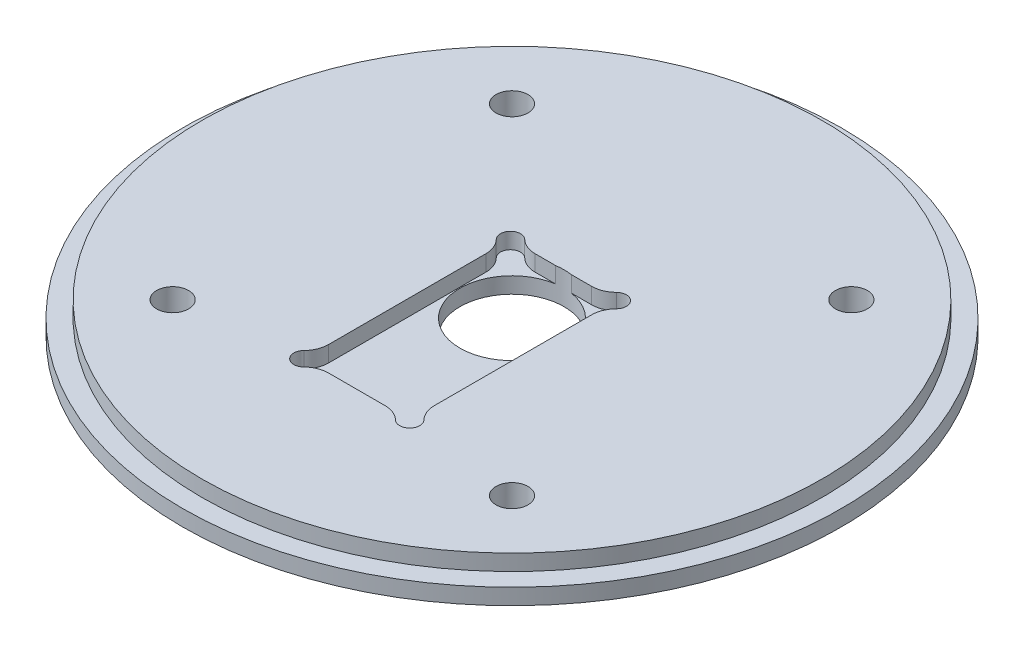
ISO-10303-21;
HEADER;
FILE_DESCRIPTION(('STEP AP214'),'2;1');
FILE_NAME('part.step','',(''),(''),'','','');
FILE_SCHEMA(('AUTOMOTIVE_DESIGN { 1 0 10303 214 1 1 1 1 }'));
ENDSEC;
DATA;
#1=APPLICATION_CONTEXT('core data for automotive mechanical design processes');
#2=APPLICATION_PROTOCOL_DEFINITION('international standard','automotive_design',2000,#1);
#3=PRODUCT_CONTEXT('',#1,'mechanical');
#4=PRODUCT('Part','Part','',(#3));
#5=PRODUCT_RELATED_PRODUCT_CATEGORY('part','',(#4));
#6=PRODUCT_DEFINITION_FORMATION('','',#4);
#7=PRODUCT_DEFINITION_CONTEXT('part definition',#1,'design');
#8=PRODUCT_DEFINITION('design','',#6,#7);
#9=PRODUCT_DEFINITION_SHAPE('','',#8);
#10=(LENGTH_UNIT() NAMED_UNIT(*) SI_UNIT(.MILLI.,.METRE.));
#11=(NAMED_UNIT(*) PLANE_ANGLE_UNIT() SI_UNIT($,.RADIAN.));
#12=(NAMED_UNIT(*) SI_UNIT($,.STERADIAN.) SOLID_ANGLE_UNIT());
#13=UNCERTAINTY_MEASURE_WITH_UNIT(LENGTH_MEASURE(1.E-05),#10,'distance_accuracy_value','');
#14=(GEOMETRIC_REPRESENTATION_CONTEXT(3) GLOBAL_UNCERTAINTY_ASSIGNED_CONTEXT((#13)) GLOBAL_UNIT_ASSIGNED_CONTEXT((#10,
#11,#12)) REPRESENTATION_CONTEXT('',''));
#15=CARTESIAN_POINT('',(0.,0.,0.));
#16=DIRECTION('',(0.,0.,1.));
#17=DIRECTION('',(1.,0.,0.));
#18=AXIS2_PLACEMENT_3D('',#15,#16,#17);
#19=CARTESIAN_POINT('',(-33.6759604540092,6.35,-33.6759604540095));
#20=DIRECTION('',(0.,1.,0.));
#21=DIRECTION('',(0.,0.,1.));
#22=AXIS2_PLACEMENT_3D('',#19,#20,#21);
#23=CYLINDRICAL_SURFACE('',#22,3.175);
#24=CARTESIAN_POINT('',(-33.6759604540092,6.35,-33.6759604540095));
#25=DIRECTION('',(0.,1.,0.));
#26=DIRECTION('',(0.,0.,1.));
#27=AXIS2_PLACEMENT_3D('',#24,#25,#26);
#28=CIRCLE('',#27,3.175);
#29=CARTESIAN_POINT('',(-33.6759604540092,6.35,-30.5009604540095));
#30=VERTEX_POINT('',#29);
#31=EDGE_CURVE('E320',#30,#30,#28,.T.);
#32=ORIENTED_EDGE('',*,*,#31,.T.);
#33=EDGE_LOOP('',(#32));
#34=FACE_BOUND('',#33,.T.);
#35=CARTESIAN_POINT('',(-33.6759604540092,1.5875,-33.6759604540095));
#36=DIRECTION('',(0.,-1.,0.));
#37=DIRECTION('',(0.,0.,-1.));
#38=AXIS2_PLACEMENT_3D('',#35,#36,#37);
#39=CIRCLE('',#38,3.175);
#40=CARTESIAN_POINT('',(-33.6759604540092,1.5875,-36.8509604540095));
#41=VERTEX_POINT('',#40);
#42=EDGE_CURVE('E43',#41,#41,#39,.F.);
#43=ORIENTED_EDGE('',*,*,#42,.F.);
#44=EDGE_LOOP('',(#43));
#45=FACE_BOUND('',#44,.T.);
#46=ADVANCED_FACE('F39',(#34,#45),#23,.F.);
#47=CARTESIAN_POINT('',(33.6759604540092,6.35,33.6759604540095));
#48=DIRECTION('',(0.,1.,0.));
#49=DIRECTION('',(0.,0.,1.));
#50=AXIS2_PLACEMENT_3D('',#47,#48,#49);
#51=CYLINDRICAL_SURFACE('',#50,3.175);
#52=CARTESIAN_POINT('',(33.6759604540092,6.35,33.6759604540095));
#53=DIRECTION('',(0.,1.,0.));
#54=DIRECTION('',(0.,0.,1.));
#55=AXIS2_PLACEMENT_3D('',#52,#53,#54);
#56=CIRCLE('',#55,3.175);
#57=CARTESIAN_POINT('',(33.6759604540092,6.35,36.8509604540095));
#58=VERTEX_POINT('',#57);
#59=EDGE_CURVE('E317',#58,#58,#56,.T.);
#60=ORIENTED_EDGE('',*,*,#59,.T.);
#61=EDGE_LOOP('',(#60));
#62=FACE_BOUND('',#61,.T.);
#63=CARTESIAN_POINT('',(33.6759604540092,1.5875,33.6759604540095));
#64=DIRECTION('',(0.,-1.,0.));
#65=DIRECTION('',(0.,0.,-1.));
#66=AXIS2_PLACEMENT_3D('',#63,#64,#65);
#67=CIRCLE('',#66,3.175);
#68=CARTESIAN_POINT('',(33.6759604540092,1.5875,30.5009604540095));
#69=VERTEX_POINT('',#68);
#70=EDGE_CURVE('E344',#69,#69,#67,.F.);
#71=ORIENTED_EDGE('',*,*,#70,.F.);
#72=EDGE_LOOP('',(#71));
#73=FACE_BOUND('',#72,.T.);
#74=ADVANCED_FACE('F354',(#62,#73),#51,.F.);
#75=CARTESIAN_POINT('',(33.6759604540095,6.35,-33.6759604540092));
#76=DIRECTION('',(0.,1.,0.));
#77=DIRECTION('',(0.,0.,1.));
#78=AXIS2_PLACEMENT_3D('',#75,#76,#77);
#79=CYLINDRICAL_SURFACE('',#78,3.175);
#80=CARTESIAN_POINT('',(33.6759604540095,6.35,-33.6759604540092));
#81=DIRECTION('',(0.,1.,0.));
#82=DIRECTION('',(0.,0.,1.));
#83=AXIS2_PLACEMENT_3D('',#80,#81,#82);
#84=CIRCLE('',#83,3.175);
#85=CARTESIAN_POINT('',(33.6759604540095,6.35,-30.5009604540092));
#86=VERTEX_POINT('',#85);
#87=EDGE_CURVE('E314',#86,#86,#84,.T.);
#88=ORIENTED_EDGE('',*,*,#87,.T.);
#89=EDGE_LOOP('',(#88));
#90=FACE_BOUND('',#89,.T.);
#91=CARTESIAN_POINT('',(33.6759604540095,1.5875,-33.6759604540092));
#92=DIRECTION('',(0.,-1.,0.));
#93=DIRECTION('',(0.,0.,-1.));
#94=AXIS2_PLACEMENT_3D('',#91,#92,#93);
#95=CIRCLE('',#94,3.175);
#96=CARTESIAN_POINT('',(33.6759604540095,1.5875,-36.8509604540092));
#97=VERTEX_POINT('',#96);
#98=EDGE_CURVE('E341',#97,#97,#95,.F.);
#99=ORIENTED_EDGE('',*,*,#98,.F.);
#100=EDGE_LOOP('',(#99));
#101=FACE_BOUND('',#100,.T.);
#102=ADVANCED_FACE('F361',(#90,#101),#79,.F.);
#103=CARTESIAN_POINT('',(-33.6759604540095,6.35,33.6759604540092));
#104=DIRECTION('',(0.,1.,0.));
#105=DIRECTION('',(0.,0.,1.));
#106=AXIS2_PLACEMENT_3D('',#103,#104,#105);
#107=CYLINDRICAL_SURFACE('',#106,3.175);
#108=CARTESIAN_POINT('',(-33.6759604540095,6.35,33.6759604540092));
#109=DIRECTION('',(0.,1.,0.));
#110=DIRECTION('',(0.,0.,1.));
#111=AXIS2_PLACEMENT_3D('',#108,#109,#110);
#112=CIRCLE('',#111,3.175);
#113=CARTESIAN_POINT('',(-33.6759604540095,6.35,36.8509604540092));
#114=VERTEX_POINT('',#113);
#115=EDGE_CURVE('E311',#114,#114,#112,.T.);
#116=ORIENTED_EDGE('',*,*,#115,.T.);
#117=EDGE_LOOP('',(#116));
#118=FACE_BOUND('',#117,.T.);
#119=CARTESIAN_POINT('',(-33.6759604540095,1.5875,33.6759604540092));
#120=DIRECTION('',(0.,-1.,0.));
#121=DIRECTION('',(0.,0.,-1.));
#122=AXIS2_PLACEMENT_3D('',#119,#120,#121);
#123=CIRCLE('',#122,3.175);
#124=CARTESIAN_POINT('',(-33.6759604540095,1.5875,30.5009604540092));
#125=VERTEX_POINT('',#124);
#126=EDGE_CURVE('E338',#125,#125,#123,.F.);
#127=ORIENTED_EDGE('',*,*,#126,.F.);
#128=EDGE_LOOP('',(#127));
#129=FACE_BOUND('',#128,.T.);
#130=ADVANCED_FACE('F386',(#118,#129),#107,.F.);
#131=CARTESIAN_POINT('',(0.,6.35,0.));
#132=DIRECTION('',(0.,-1.,0.));
#133=DIRECTION('',(0.,0.,-1.));
#134=AXIS2_PLACEMENT_3D('',#131,#132,#133);
#135=CYLINDRICAL_SURFACE('',#134,65.405);
#136=CARTESIAN_POINT('',(0.,0.,0.));
#137=DIRECTION('',(0.,1.,0.));
#138=DIRECTION('',(0.,0.,1.));
#139=AXIS2_PLACEMENT_3D('',#136,#137,#138);
#140=CIRCLE('',#139,65.405);
#141=CARTESIAN_POINT('',(0.,0.,65.405));
#142=VERTEX_POINT('',#141);
#143=EDGE_CURVE('E332',#142,#142,#140,.T.);
#144=ORIENTED_EDGE('',*,*,#143,.T.);
#145=EDGE_LOOP('',(#144));
#146=FACE_BOUND('',#145,.T.);
#147=CARTESIAN_POINT('',(0.,3.175,0.));
#148=DIRECTION('',(0.,1.,0.));
#149=DIRECTION('',(0.,0.,1.));
#150=AXIS2_PLACEMENT_3D('',#147,#148,#149);
#151=CIRCLE('',#150,65.405);
#152=CARTESIAN_POINT('',(0.,3.175,65.405));
#153=VERTEX_POINT('',#152);
#154=EDGE_CURVE('E327',#153,#153,#151,.T.);
#155=ORIENTED_EDGE('',*,*,#154,.F.);
#156=EDGE_LOOP('',(#155));
#157=FACE_BOUND('',#156,.T.);
#158=ADVANCED_FACE('F41',(#146,#157),#135,.T.);
#159=CARTESIAN_POINT('',(0.,0.,0.));
#160=DIRECTION('',(0.,1.,0.));
#161=DIRECTION('',(0.,0.,1.));
#162=AXIS2_PLACEMENT_3D('',#159,#160,#161);
#163=PLANE('',#162);
#164=CARTESIAN_POINT('',(-33.6759604540092,0.,-33.6759604540095));
#165=DIRECTION('',(0.,-1.,0.));
#166=DIRECTION('',(0.,0.,-1.));
#167=AXIS2_PLACEMENT_3D('',#164,#165,#166);
#168=CIRCLE('',#167,6.0325);
#169=CARTESIAN_POINT('',(-33.6759604540092,0.,-39.7084604540095));
#170=VERTEX_POINT('',#169);
#171=EDGE_CURVE('E391',#170,#170,#168,.T.);
#172=ORIENTED_EDGE('',*,*,#171,.F.);
#173=EDGE_LOOP('',(#172));
#174=FACE_BOUND('',#173,.T.);
#175=CARTESIAN_POINT('',(33.6759604540095,0.,-33.6759604540092));
#176=DIRECTION('',(0.,-1.,0.));
#177=DIRECTION('',(0.,0.,-1.));
#178=AXIS2_PLACEMENT_3D('',#175,#176,#177);
#179=CIRCLE('',#178,6.0325);
#180=CARTESIAN_POINT('',(33.6759604540095,0.,-39.7084604540092));
#181=VERTEX_POINT('',#180);
#182=EDGE_CURVE('E395',#181,#181,#179,.T.);
#183=ORIENTED_EDGE('',*,*,#182,.F.);
#184=EDGE_LOOP('',(#183));
#185=FACE_BOUND('',#184,.T.);
#186=CARTESIAN_POINT('',(33.6759604540092,0.,33.6759604540095));
#187=DIRECTION('',(0.,-1.,0.));
#188=DIRECTION('',(0.,0.,-1.));
#189=AXIS2_PLACEMENT_3D('',#186,#187,#188);
#190=CIRCLE('',#189,6.0325);
#191=CARTESIAN_POINT('',(33.6759604540092,0.,27.6434604540095));
#192=VERTEX_POINT('',#191);
#193=EDGE_CURVE('E399',#192,#192,#190,.T.);
#194=ORIENTED_EDGE('',*,*,#193,.F.);
#195=EDGE_LOOP('',(#194));
#196=FACE_BOUND('',#195,.T.);
#197=CARTESIAN_POINT('',(-33.6759604540095,0.,33.6759604540092));
#198=DIRECTION('',(0.,-1.,0.));
#199=DIRECTION('',(0.,0.,-1.));
#200=AXIS2_PLACEMENT_3D('',#197,#198,#199);
#201=CIRCLE('',#200,6.0325);
#202=CARTESIAN_POINT('',(-33.6759604540095,0.,27.6434604540092));
#203=VERTEX_POINT('',#202);
#204=EDGE_CURVE('E196',#203,#203,#201,.T.);
#205=ORIENTED_EDGE('',*,*,#204,.F.);
#206=EDGE_LOOP('',(#205));
#207=FACE_BOUND('',#206,.T.);
#208=CARTESIAN_POINT('',(0.,0.,0.));
#209=DIRECTION('',(0.,1.,0.));
#210=DIRECTION('',(0.,0.,1.));
#211=AXIS2_PLACEMENT_3D('',#208,#209,#210);
#212=CIRCLE('',#211,10.31875);
#213=CARTESIAN_POINT('',(0.,0.,10.31875));
#214=VERTEX_POINT('',#213);
#215=EDGE_CURVE('E308',#214,#214,#212,.T.);
#216=ORIENTED_EDGE('',*,*,#215,.T.);
#217=EDGE_LOOP('',(#216));
#218=FACE_BOUND('',#217,.T.);
#219=ORIENTED_EDGE('',*,*,#143,.F.);
#220=EDGE_LOOP('',(#219));
#221=FACE_BOUND('',#220,.T.);
#222=ADVANCED_FACE('F374',(#174,#185,#196,#207,#218,#221),#163,.F.);
#223=CARTESIAN_POINT('',(0.,3.175,0.));
#224=DIRECTION('',(0.,1.,0.));
#225=DIRECTION('',(0.,0.,1.));
#226=AXIS2_PLACEMENT_3D('',#223,#224,#225);
#227=PLANE('',#226);
#228=CARTESIAN_POINT('',(0.,3.175,0.));
#229=DIRECTION('',(0.,1.,0.));
#230=DIRECTION('',(0.,0.,1.));
#231=AXIS2_PLACEMENT_3D('',#228,#229,#230);
#232=CIRCLE('',#231,61.595);
#233=CARTESIAN_POINT('',(0.,3.175,61.595));
#234=VERTEX_POINT('',#233);
#235=EDGE_CURVE('E324',#234,#234,#232,.T.);
#236=ORIENTED_EDGE('',*,*,#235,.F.);
#237=EDGE_LOOP('',(#236));
#238=FACE_BOUND('',#237,.T.);
#239=ORIENTED_EDGE('',*,*,#154,.T.);
#240=EDGE_LOOP('',(#239));
#241=FACE_BOUND('',#240,.T.);
#242=ADVANCED_FACE('F370',(#238,#241),#227,.T.);
#243=CARTESIAN_POINT('',(0.,3.175,0.));
#244=DIRECTION('',(0.,1.,0.));
#245=DIRECTION('',(0.,0.,1.));
#246=AXIS2_PLACEMENT_3D('',#243,#244,#245);
#247=CYLINDRICAL_SURFACE('',#246,61.595);
#248=ORIENTED_EDGE('',*,*,#235,.T.);
#249=EDGE_LOOP('',(#248));
#250=FACE_BOUND('',#249,.T.);
#251=CARTESIAN_POINT('',(0.,6.35,0.));
#252=DIRECTION('',(0.,1.,0.));
#253=DIRECTION('',(0.,0.,1.));
#254=AXIS2_PLACEMENT_3D('',#251,#252,#253);
#255=CIRCLE('',#254,61.595);
#256=CARTESIAN_POINT('',(0.,6.35,61.595));
#257=VERTEX_POINT('',#256);
#258=EDGE_CURVE('E323',#257,#257,#255,.T.);
#259=ORIENTED_EDGE('',*,*,#258,.F.);
#260=EDGE_LOOP('',(#259));
#261=FACE_BOUND('',#260,.T.);
#262=ADVANCED_FACE('F366',(#250,#261),#247,.T.);
#263=CARTESIAN_POINT('',(0.,6.35,0.));
#264=DIRECTION('',(0.,1.,0.));
#265=DIRECTION('',(0.,0.,1.));
#266=AXIS2_PLACEMENT_3D('',#263,#264,#265);
#267=PLANE('',#266);
#268=DIRECTION('',(-1.,0.,0.));
#269=VECTOR('',#268,1.);
#270=CARTESIAN_POINT('',(-5.60102051443364,6.35,-10.2));
#271=LINE('',#270,#269);
#272=CARTESIAN_POINT('',(-1.56096174280472,6.35,-10.2));
#273=VERTEX_POINT('',#272);
#274=CARTESIAN_POINT('',(-5.60102051443364,6.35,-10.2));
#275=VERTEX_POINT('',#274);
#276=EDGE_CURVE('E264',#273,#275,#271,.T.);
#277=ORIENTED_EDGE('',*,*,#276,.F.);
#278=CARTESIAN_POINT('',(0.,6.35,0.));
#279=DIRECTION('',(0.,1.,0.));
#280=DIRECTION('',(0.,0.,1.));
#281=AXIS2_PLACEMENT_3D('',#278,#279,#280);
#282=CIRCLE('',#281,10.31875);
#283=CARTESIAN_POINT('',(1.56096174280472,6.35,-10.2));
#284=VERTEX_POINT('',#283);
#285=EDGE_CURVE('E277',#284,#273,#282,.T.);
#286=ORIENTED_EDGE('',*,*,#285,.F.);
#287=CARTESIAN_POINT('',(5.60102051443364,6.35,-10.2));
#288=VERTEX_POINT('',#287);
#289=EDGE_CURVE('E265',#288,#284,#271,.T.);
#290=ORIENTED_EDGE('',*,*,#289,.F.);
#291=CARTESIAN_POINT('',(5.60102051443364,6.35,-15.2));
#292=DIRECTION('',(0.,-1.,0.));
#293=DIRECTION('',(0.,0.,-1.));
#294=AXIS2_PLACEMENT_3D('',#291,#292,#293);
#295=CIRCLE('',#294,5.);
#296=CARTESIAN_POINT('',(9.10029157555247,6.35,-11.6285714285714));
#297=VERTEX_POINT('',#296);
#298=EDGE_CURVE('E261',#297,#288,#295,.T.);
#299=ORIENTED_EDGE('',*,*,#298,.F.);
#300=CARTESIAN_POINT('',(10.5,6.35,-10.2));
#301=DIRECTION('',(0.,1.,0.));
#302=DIRECTION('',(0.,0.,1.));
#303=AXIS2_PLACEMENT_3D('',#300,#301,#302);
#304=CIRCLE('',#303,2.);
#305=CARTESIAN_POINT('',(11.9285714285714,6.35,-8.80029157555247));
#306=VERTEX_POINT('',#305);
#307=EDGE_CURVE('E258',#306,#297,#304,.T.);
#308=ORIENTED_EDGE('',*,*,#307,.F.);
#309=CARTESIAN_POINT('',(15.5,6.35,-5.30102051443365));
#310=DIRECTION('',(0.,-1.,0.));
#311=DIRECTION('',(0.,0.,1.));
#312=AXIS2_PLACEMENT_3D('',#309,#310,#311);
#313=CIRCLE('',#312,5.);
#314=CARTESIAN_POINT('',(10.5,6.35,-5.30102051443365));
#315=VERTEX_POINT('',#314);
#316=EDGE_CURVE('E255',#315,#306,#313,.T.);
#317=ORIENTED_EDGE('',*,*,#316,.F.);
#318=DIRECTION('',(0.,0.,-1.));
#319=VECTOR('',#318,1.);
#320=CARTESIAN_POINT('',(10.5,6.35,-5.30102051443365));
#321=LINE('',#320,#319);
#322=CARTESIAN_POINT('',(10.5,6.35,25.9010205144336));
#323=VERTEX_POINT('',#322);
#324=EDGE_CURVE('E252',#323,#315,#321,.T.);
#325=ORIENTED_EDGE('',*,*,#324,.F.);
#326=CARTESIAN_POINT('',(15.5,6.35,25.9010205144336));
#327=DIRECTION('',(0.,-1.,0.));
#328=DIRECTION('',(0.,0.,-1.));
#329=AXIS2_PLACEMENT_3D('',#326,#327,#328);
#330=CIRCLE('',#329,5.);
#331=CARTESIAN_POINT('',(11.9285714285714,6.35,29.4002915755525));
#332=VERTEX_POINT('',#331);
#333=EDGE_CURVE('E249',#332,#323,#330,.T.);
#334=ORIENTED_EDGE('',*,*,#333,.F.);
#335=CARTESIAN_POINT('',(10.5,6.35,30.8));
#336=DIRECTION('',(0.,1.,0.));
#337=DIRECTION('',(0.,0.,-1.));
#338=AXIS2_PLACEMENT_3D('',#335,#336,#337);
#339=CIRCLE('',#338,2.);
#340=CARTESIAN_POINT('',(9.10029157555247,6.35,32.2285714285714));
#341=VERTEX_POINT('',#340);
#342=EDGE_CURVE('E246',#341,#332,#339,.T.);
#343=ORIENTED_EDGE('',*,*,#342,.F.);
#344=CARTESIAN_POINT('',(5.60102051443364,6.35,35.8));
#345=DIRECTION('',(0.,-1.,0.));
#346=DIRECTION('',(0.,0.,1.));
#347=AXIS2_PLACEMENT_3D('',#344,#345,#346);
#348=CIRCLE('',#347,5.);
#349=CARTESIAN_POINT('',(5.60102051443364,6.35,30.8));
#350=VERTEX_POINT('',#349);
#351=EDGE_CURVE('E243',#350,#341,#348,.T.);
#352=ORIENTED_EDGE('',*,*,#351,.F.);
#353=DIRECTION('',(1.,0.,0.));
#354=VECTOR('',#353,1.);
#355=CARTESIAN_POINT('',(-5.60102051443364,6.35,30.8));
#356=LINE('',#355,#354);
#357=CARTESIAN_POINT('',(-5.60102051443364,6.35,30.8));
#358=VERTEX_POINT('',#357);
#359=EDGE_CURVE('E240',#358,#350,#356,.T.);
#360=ORIENTED_EDGE('',*,*,#359,.F.);
#361=CARTESIAN_POINT('',(-5.60102051443364,6.35,35.8));
#362=DIRECTION('',(0.,-1.,0.));
#363=DIRECTION('',(0.,0.,-1.));
#364=AXIS2_PLACEMENT_3D('',#361,#362,#363);
#365=CIRCLE('',#364,5.);
#366=CARTESIAN_POINT('',(-9.10029157555246,6.35,32.2285714285714));
#367=VERTEX_POINT('',#366);
#368=EDGE_CURVE('E237',#367,#358,#365,.T.);
#369=ORIENTED_EDGE('',*,*,#368,.F.);
#370=CARTESIAN_POINT('',(-10.5,6.35,30.8));
#371=DIRECTION('',(0.,1.,0.));
#372=DIRECTION('',(0.,0.,1.));
#373=AXIS2_PLACEMENT_3D('',#370,#371,#372);
#374=CIRCLE('',#373,2.);
#375=CARTESIAN_POINT('',(-11.9285714285714,6.35,29.4002915755525));
#376=VERTEX_POINT('',#375);
#377=EDGE_CURVE('E235',#376,#367,#374,.T.);
#378=ORIENTED_EDGE('',*,*,#377,.F.);
#379=CARTESIAN_POINT('',(-15.5,6.35,25.9010205144336));
#380=DIRECTION('',(0.,-1.,0.));
#381=DIRECTION('',(0.,0.,1.));
#382=AXIS2_PLACEMENT_3D('',#379,#380,#381);
#383=CIRCLE('',#382,5.);
#384=CARTESIAN_POINT('',(-10.5,6.35,25.9010205144336));
#385=VERTEX_POINT('',#384);
#386=EDGE_CURVE('E173',#385,#376,#383,.T.);
#387=ORIENTED_EDGE('',*,*,#386,.F.);
#388=DIRECTION('',(0.,0.,1.));
#389=VECTOR('',#388,1.);
#390=CARTESIAN_POINT('',(-10.5,6.35,-5.30102051443365));
#391=LINE('',#390,#389);
#392=CARTESIAN_POINT('',(-10.5,6.35,-5.30102051443365));
#393=VERTEX_POINT('',#392);
#394=EDGE_CURVE('E190',#393,#385,#391,.T.);
#395=ORIENTED_EDGE('',*,*,#394,.F.);
#396=CARTESIAN_POINT('',(-15.5,6.35,-5.30102051443365));
#397=DIRECTION('',(0.,-1.,0.));
#398=DIRECTION('',(0.,0.,-1.));
#399=AXIS2_PLACEMENT_3D('',#396,#397,#398);
#400=CIRCLE('',#399,5.);
#401=CARTESIAN_POINT('',(-11.9285714285714,6.35,-8.80029157555247));
#402=VERTEX_POINT('',#401);
#403=EDGE_CURVE('E193',#402,#393,#400,.T.);
#404=ORIENTED_EDGE('',*,*,#403,.F.);
#405=CARTESIAN_POINT('',(-10.5,6.35,-10.2));
#406=DIRECTION('',(0.,1.,0.));
#407=DIRECTION('',(0.,0.,-1.));
#408=AXIS2_PLACEMENT_3D('',#405,#406,#407);
#409=CIRCLE('',#408,2.);
#410=CARTESIAN_POINT('',(-9.10029157555247,6.35,-11.6285714285714));
#411=VERTEX_POINT('',#410);
#412=EDGE_CURVE('E270',#411,#402,#409,.T.);
#413=ORIENTED_EDGE('',*,*,#412,.F.);
#414=CARTESIAN_POINT('',(-5.60102051443364,6.35,-15.2));
#415=DIRECTION('',(0.,-1.,0.));
#416=DIRECTION('',(0.,0.,1.));
#417=AXIS2_PLACEMENT_3D('',#414,#415,#416);
#418=CIRCLE('',#417,5.);
#419=EDGE_CURVE('E267',#275,#411,#418,.T.);
#420=ORIENTED_EDGE('',*,*,#419,.F.);
#421=EDGE_LOOP('',(#277,#286,#290,#299,#308,#317,#325,#334,#343,#352,#360,#369,#378,#387,#395,
#404,#413,#420));
#422=FACE_BOUND('',#421,.T.);
#423=ORIENTED_EDGE('',*,*,#115,.F.);
#424=EDGE_LOOP('',(#423));
#425=FACE_BOUND('',#424,.T.);
#426=ORIENTED_EDGE('',*,*,#87,.F.);
#427=EDGE_LOOP('',(#426));
#428=FACE_BOUND('',#427,.T.);
#429=ORIENTED_EDGE('',*,*,#59,.F.);
#430=EDGE_LOOP('',(#429));
#431=FACE_BOUND('',#430,.T.);
#432=ORIENTED_EDGE('',*,*,#31,.F.);
#433=EDGE_LOOP('',(#432));
#434=FACE_BOUND('',#433,.T.);
#435=ORIENTED_EDGE('',*,*,#258,.T.);
#436=EDGE_LOOP('',(#435));
#437=FACE_BOUND('',#436,.T.);
#438=ADVANCED_FACE('F369',(#422,#425,#428,#431,#434,#437),#267,.T.);
#439=CARTESIAN_POINT('',(0.,6.35,0.));
#440=DIRECTION('',(0.,1.,0.));
#441=DIRECTION('',(0.,0.,1.));
#442=AXIS2_PLACEMENT_3D('',#439,#440,#441);
#443=CYLINDRICAL_SURFACE('',#442,10.31875);
#444=ORIENTED_EDGE('',*,*,#285,.T.);
#445=DIRECTION('',(0.,1.,0.));
#446=VECTOR('',#445,1.);
#447=CARTESIAN_POINT('',(-1.56096174280472,6.35,-10.2));
#448=LINE('',#447,#446);
#449=CARTESIAN_POINT('',(-1.56096174280472,3.175,-10.2));
#450=VERTEX_POINT('',#449);
#451=EDGE_CURVE('E11',#273,#450,#448,.F.);
#452=ORIENTED_EDGE('',*,*,#451,.T.);
#453=CARTESIAN_POINT('',(0.,3.175,0.));
#454=DIRECTION('',(0.,1.,0.));
#455=DIRECTION('',(0.,0.,1.));
#456=AXIS2_PLACEMENT_3D('',#453,#454,#455);
#457=CIRCLE('',#456,10.31875);
#458=CARTESIAN_POINT('',(1.56096174280472,3.175,-10.2));
#459=VERTEX_POINT('',#458);
#460=EDGE_CURVE('E61',#459,#450,#457,.F.);
#461=ORIENTED_EDGE('',*,*,#460,.F.);
#462=DIRECTION('',(0.,1.,0.));
#463=VECTOR('',#462,1.);
#464=CARTESIAN_POINT('',(1.56096174280472,6.35,-10.2));
#465=LINE('',#464,#463);
#466=EDGE_CURVE('E48',#459,#284,#465,.T.);
#467=ORIENTED_EDGE('',*,*,#466,.T.);
#468=EDGE_LOOP('',(#444,#452,#461,#467));
#469=FACE_BOUND('',#468,.T.);
#470=ORIENTED_EDGE('',*,*,#215,.F.);
#471=EDGE_LOOP('',(#470));
#472=FACE_BOUND('',#471,.T.);
#473=ADVANCED_FACE('F377',(#469,#472),#443,.F.);
#474=CARTESIAN_POINT('',(-5.60102051443364,3.175,-10.2));
#475=DIRECTION('',(0.,0.,-1.));
#476=DIRECTION('',(-1.,0.,0.));
#477=AXIS2_PLACEMENT_3D('',#474,#475,#476);
#478=PLANE('',#477);
#479=ORIENTED_EDGE('',*,*,#276,.T.);
#480=DIRECTION('',(0.,1.,0.));
#481=VECTOR('',#480,1.);
#482=CARTESIAN_POINT('',(-5.60102051443364,3.175,-10.2));
#483=LINE('',#482,#481);
#484=CARTESIAN_POINT('',(-5.60102051443364,3.175,-10.2));
#485=VERTEX_POINT('',#484);
#486=EDGE_CURVE('E284',#485,#275,#483,.T.);
#487=ORIENTED_EDGE('',*,*,#486,.F.);
#488=DIRECTION('',(-1.,0.,0.));
#489=VECTOR('',#488,1.);
#490=CARTESIAN_POINT('',(-5.60102051443364,3.175,-10.2));
#491=LINE('',#490,#489);
#492=EDGE_CURVE('E223',#450,#485,#491,.T.);
#493=ORIENTED_EDGE('',*,*,#492,.F.);
#494=ORIENTED_EDGE('',*,*,#451,.F.);
#495=EDGE_LOOP('',(#479,#487,#493,#494));
#496=FACE_BOUND('',#495,.T.);
#497=ADVANCED_FACE('F411',(#496),#478,.F.);
#498=CARTESIAN_POINT('',(5.60102051443364,3.175,-10.2));
#499=VERTEX_POINT('',#498);
#500=EDGE_CURVE('E56',#499,#459,#491,.T.);
#501=ORIENTED_EDGE('',*,*,#500,.F.);
#502=DIRECTION('',(0.,1.,0.));
#503=VECTOR('',#502,1.);
#504=CARTESIAN_POINT('',(5.60102051443364,3.175,-10.2));
#505=LINE('',#504,#503);
#506=EDGE_CURVE('E287',#499,#288,#505,.T.);
#507=ORIENTED_EDGE('',*,*,#506,.T.);
#508=ORIENTED_EDGE('',*,*,#289,.T.);
#509=ORIENTED_EDGE('',*,*,#466,.F.);
#510=EDGE_LOOP('',(#501,#507,#508,#509));
#511=FACE_BOUND('',#510,.T.);
#512=ADVANCED_FACE('F417',(#511),#478,.F.);
#513=CARTESIAN_POINT('',(-15.5,3.175,25.9010205144336));
#514=DIRECTION('',(0.,1.,0.));
#515=DIRECTION('',(0.,0.,1.));
#516=AXIS2_PLACEMENT_3D('',#513,#514,#515);
#517=PLANE('',#516);
#518=ORIENTED_EDGE('',*,*,#460,.T.);
#519=ORIENTED_EDGE('',*,*,#492,.T.);
#520=CARTESIAN_POINT('',(-5.60102051443364,3.175,-15.2));
#521=DIRECTION('',(0.,-1.,0.));
#522=DIRECTION('',(0.,0.,1.));
#523=AXIS2_PLACEMENT_3D('',#520,#521,#522);
#524=CIRCLE('',#523,5.);
#525=CARTESIAN_POINT('',(-9.10029157555247,3.175,-11.6285714285714));
#526=VERTEX_POINT('',#525);
#527=EDGE_CURVE('E225',#485,#526,#524,.T.);
#528=ORIENTED_EDGE('',*,*,#527,.T.);
#529=CARTESIAN_POINT('',(-10.5,3.175,-10.2));
#530=DIRECTION('',(0.,1.,0.));
#531=DIRECTION('',(0.,0.,-1.));
#532=AXIS2_PLACEMENT_3D('',#529,#530,#531);
#533=CIRCLE('',#532,2.);
#534=CARTESIAN_POINT('',(-11.9285714285714,3.175,-8.80029157555247));
#535=VERTEX_POINT('',#534);
#536=EDGE_CURVE('E228',#526,#535,#533,.T.);
#537=ORIENTED_EDGE('',*,*,#536,.T.);
#538=CARTESIAN_POINT('',(-15.5,3.175,-5.30102051443365));
#539=DIRECTION('',(0.,-1.,0.));
#540=DIRECTION('',(0.,0.,-1.));
#541=AXIS2_PLACEMENT_3D('',#538,#539,#540);
#542=CIRCLE('',#541,5.);
#543=CARTESIAN_POINT('',(-10.5,3.175,-5.30102051443365));
#544=VERTEX_POINT('',#543);
#545=EDGE_CURVE('E231',#535,#544,#542,.T.);
#546=ORIENTED_EDGE('',*,*,#545,.T.);
#547=DIRECTION('',(0.,0.,1.));
#548=VECTOR('',#547,1.);
#549=CARTESIAN_POINT('',(-10.5,3.175,-5.30102051443365));
#550=LINE('',#549,#548);
#551=CARTESIAN_POINT('',(-10.5,3.175,25.9010205144336));
#552=VERTEX_POINT('',#551);
#553=EDGE_CURVE('E178',#544,#552,#550,.T.);
#554=ORIENTED_EDGE('',*,*,#553,.T.);
#555=CARTESIAN_POINT('',(-15.5,3.175,25.9010205144336));
#556=DIRECTION('',(0.,-1.,0.));
#557=DIRECTION('',(0.,0.,1.));
#558=AXIS2_PLACEMENT_3D('',#555,#556,#557);
#559=CIRCLE('',#558,5.);
#560=CARTESIAN_POINT('',(-11.9285714285714,3.175,29.4002915755525));
#561=VERTEX_POINT('',#560);
#562=EDGE_CURVE('E170',#552,#561,#559,.T.);
#563=ORIENTED_EDGE('',*,*,#562,.T.);
#564=CARTESIAN_POINT('',(-10.5,3.175,30.8));
#565=DIRECTION('',(0.,1.,0.));
#566=DIRECTION('',(0.,0.,1.));
#567=AXIS2_PLACEMENT_3D('',#564,#565,#566);
#568=CIRCLE('',#567,2.);
#569=CARTESIAN_POINT('',(-9.10029157555246,3.175,32.2285714285714));
#570=VERTEX_POINT('',#569);
#571=EDGE_CURVE('E181',#561,#570,#568,.T.);
#572=ORIENTED_EDGE('',*,*,#571,.T.);
#573=CARTESIAN_POINT('',(-5.60102051443364,3.175,35.8));
#574=DIRECTION('',(0.,-1.,0.));
#575=DIRECTION('',(0.,0.,-1.));
#576=AXIS2_PLACEMENT_3D('',#573,#574,#575);
#577=CIRCLE('',#576,5.);
#578=CARTESIAN_POINT('',(-5.60102051443364,3.175,30.8));
#579=VERTEX_POINT('',#578);
#580=EDGE_CURVE('E185',#570,#579,#577,.T.);
#581=ORIENTED_EDGE('',*,*,#580,.T.);
#582=DIRECTION('',(1.,0.,0.));
#583=VECTOR('',#582,1.);
#584=CARTESIAN_POINT('',(-5.60102051443364,3.175,30.8));
#585=LINE('',#584,#583);
#586=CARTESIAN_POINT('',(5.60102051443364,3.175,30.8));
#587=VERTEX_POINT('',#586);
#588=EDGE_CURVE('E200',#579,#587,#585,.T.);
#589=ORIENTED_EDGE('',*,*,#588,.T.);
#590=CARTESIAN_POINT('',(5.60102051443364,3.175,35.8));
#591=DIRECTION('',(0.,-1.,0.));
#592=DIRECTION('',(0.,0.,1.));
#593=AXIS2_PLACEMENT_3D('',#590,#591,#592);
#594=CIRCLE('',#593,5.);
#595=CARTESIAN_POINT('',(9.10029157555247,3.175,32.2285714285714));
#596=VERTEX_POINT('',#595);
#597=EDGE_CURVE('E203',#587,#596,#594,.T.);
#598=ORIENTED_EDGE('',*,*,#597,.T.);
#599=CARTESIAN_POINT('',(10.5,3.175,30.8));
#600=DIRECTION('',(0.,1.,0.));
#601=DIRECTION('',(0.,0.,-1.));
#602=AXIS2_PLACEMENT_3D('',#599,#600,#601);
#603=CIRCLE('',#602,2.);
#604=CARTESIAN_POINT('',(11.9285714285714,3.175,29.4002915755525));
#605=VERTEX_POINT('',#604);
#606=EDGE_CURVE('E206',#596,#605,#603,.T.);
#607=ORIENTED_EDGE('',*,*,#606,.T.);
#608=CARTESIAN_POINT('',(15.5,3.175,25.9010205144336));
#609=DIRECTION('',(0.,-1.,0.));
#610=DIRECTION('',(0.,0.,-1.));
#611=AXIS2_PLACEMENT_3D('',#608,#609,#610);
#612=CIRCLE('',#611,5.);
#613=CARTESIAN_POINT('',(10.5,3.175,25.9010205144336));
#614=VERTEX_POINT('',#613);
#615=EDGE_CURVE('E209',#605,#614,#612,.T.);
#616=ORIENTED_EDGE('',*,*,#615,.T.);
#617=DIRECTION('',(0.,0.,-1.));
#618=VECTOR('',#617,1.);
#619=CARTESIAN_POINT('',(10.5,3.175,-5.30102051443365));
#620=LINE('',#619,#618);
#621=CARTESIAN_POINT('',(10.5,3.175,-5.30102051443365));
#622=VERTEX_POINT('',#621);
#623=EDGE_CURVE('E212',#614,#622,#620,.T.);
#624=ORIENTED_EDGE('',*,*,#623,.T.);
#625=CARTESIAN_POINT('',(15.5,3.175,-5.30102051443365));
#626=DIRECTION('',(0.,-1.,0.));
#627=DIRECTION('',(0.,0.,1.));
#628=AXIS2_PLACEMENT_3D('',#625,#626,#627);
#629=CIRCLE('',#628,5.);
#630=CARTESIAN_POINT('',(11.9285714285714,3.175,-8.80029157555247));
#631=VERTEX_POINT('',#630);
#632=EDGE_CURVE('E215',#622,#631,#629,.T.);
#633=ORIENTED_EDGE('',*,*,#632,.T.);
#634=CARTESIAN_POINT('',(10.5,3.175,-10.2));
#635=DIRECTION('',(0.,1.,0.));
#636=DIRECTION('',(0.,0.,1.));
#637=AXIS2_PLACEMENT_3D('',#634,#635,#636);
#638=CIRCLE('',#637,2.);
#639=CARTESIAN_POINT('',(9.10029157555247,3.175,-11.6285714285714));
#640=VERTEX_POINT('',#639);
#641=EDGE_CURVE('E218',#631,#640,#638,.T.);
#642=ORIENTED_EDGE('',*,*,#641,.T.);
#643=CARTESIAN_POINT('',(5.60102051443364,3.175,-15.2));
#644=DIRECTION('',(0.,-1.,0.));
#645=DIRECTION('',(0.,0.,-1.));
#646=AXIS2_PLACEMENT_3D('',#643,#644,#645);
#647=CIRCLE('',#646,5.);
#648=EDGE_CURVE('E221',#640,#499,#647,.T.);
#649=ORIENTED_EDGE('',*,*,#648,.T.);
#650=ORIENTED_EDGE('',*,*,#500,.T.);
#651=EDGE_LOOP('',(#518,#519,#528,#537,#546,#554,#563,#572,#581,#589,#598,#607,#616,#624,#633,
#642,#649,#650));
#652=FACE_BOUND('',#651,.T.);
#653=ADVANCED_FACE('F187',(#652),#517,.T.);
#654=CARTESIAN_POINT('',(-15.5,3.175,25.9010205144336));
#655=DIRECTION('',(0.,1.,0.));
#656=DIRECTION('',(0.,0.,1.));
#657=AXIS2_PLACEMENT_3D('',#654,#655,#656);
#658=CYLINDRICAL_SURFACE('',#657,5.);
#659=ORIENTED_EDGE('',*,*,#386,.T.);
#660=DIRECTION('',(0.,1.,0.));
#661=VECTOR('',#660,1.);
#662=CARTESIAN_POINT('',(-11.9285714285714,3.175,29.4002915755525));
#663=LINE('',#662,#661);
#664=EDGE_CURVE('E166',#561,#376,#663,.T.);
#665=ORIENTED_EDGE('',*,*,#664,.F.);
#666=ORIENTED_EDGE('',*,*,#562,.F.);
#667=DIRECTION('',(0.,1.,0.));
#668=VECTOR('',#667,1.);
#669=CARTESIAN_POINT('',(-10.5,3.175,25.9010205144336));
#670=LINE('',#669,#668);
#671=EDGE_CURVE('E275',#552,#385,#670,.T.);
#672=ORIENTED_EDGE('',*,*,#671,.T.);
#673=EDGE_LOOP('',(#659,#665,#666,#672));
#674=FACE_BOUND('',#673,.T.);
#675=ADVANCED_FACE('F168',(#674),#658,.T.);
#676=CARTESIAN_POINT('',(-10.5,3.175,-5.30102051443365));
#677=DIRECTION('',(-1.,0.,0.));
#678=DIRECTION('',(0.,0.,1.));
#679=AXIS2_PLACEMENT_3D('',#676,#677,#678);
#680=PLANE('',#679);
#681=ORIENTED_EDGE('',*,*,#394,.T.);
#682=ORIENTED_EDGE('',*,*,#671,.F.);
#683=ORIENTED_EDGE('',*,*,#553,.F.);
#684=DIRECTION('',(0.,1.,0.));
#685=VECTOR('',#684,1.);
#686=CARTESIAN_POINT('',(-10.5,3.175,-5.30102051443365));
#687=LINE('',#686,#685);
#688=EDGE_CURVE('E278',#544,#393,#687,.T.);
#689=ORIENTED_EDGE('',*,*,#688,.T.);
#690=EDGE_LOOP('',(#681,#682,#683,#689));
#691=FACE_BOUND('',#690,.T.);
#692=ADVANCED_FACE('F463',(#691),#680,.F.);
#693=CARTESIAN_POINT('',(-15.5,3.175,-5.30102051443365));
#694=DIRECTION('',(0.,1.,0.));
#695=DIRECTION('',(0.,0.,1.));
#696=AXIS2_PLACEMENT_3D('',#693,#694,#695);
#697=CYLINDRICAL_SURFACE('',#696,5.);
#698=ORIENTED_EDGE('',*,*,#403,.T.);
#699=ORIENTED_EDGE('',*,*,#688,.F.);
#700=ORIENTED_EDGE('',*,*,#545,.F.);
#701=DIRECTION('',(0.,1.,0.));
#702=VECTOR('',#701,1.);
#703=CARTESIAN_POINT('',(-11.9285714285714,3.175,-8.80029157555247));
#704=LINE('',#703,#702);
#705=EDGE_CURVE('E280',#535,#402,#704,.T.);
#706=ORIENTED_EDGE('',*,*,#705,.T.);
#707=EDGE_LOOP('',(#698,#699,#700,#706));
#708=FACE_BOUND('',#707,.T.);
#709=ADVANCED_FACE('F466',(#708),#697,.T.);
#710=CARTESIAN_POINT('',(-10.5,3.175,-10.2));
#711=DIRECTION('',(0.,1.,0.));
#712=DIRECTION('',(0.,0.,1.));
#713=AXIS2_PLACEMENT_3D('',#710,#711,#712);
#714=CYLINDRICAL_SURFACE('',#713,2.);
#715=ORIENTED_EDGE('',*,*,#412,.T.);
#716=ORIENTED_EDGE('',*,*,#705,.F.);
#717=ORIENTED_EDGE('',*,*,#536,.F.);
#718=DIRECTION('',(0.,1.,0.));
#719=VECTOR('',#718,1.);
#720=CARTESIAN_POINT('',(-9.10029157555247,3.175,-11.6285714285714));
#721=LINE('',#720,#719);
#722=EDGE_CURVE('E282',#526,#411,#721,.T.);
#723=ORIENTED_EDGE('',*,*,#722,.T.);
#724=EDGE_LOOP('',(#715,#716,#717,#723));
#725=FACE_BOUND('',#724,.T.);
#726=ADVANCED_FACE('F470',(#725),#714,.F.);
#727=CARTESIAN_POINT('',(-5.60102051443364,3.175,-15.2));
#728=DIRECTION('',(0.,1.,0.));
#729=DIRECTION('',(0.,0.,1.));
#730=AXIS2_PLACEMENT_3D('',#727,#728,#729);
#731=CYLINDRICAL_SURFACE('',#730,5.);
#732=ORIENTED_EDGE('',*,*,#419,.T.);
#733=ORIENTED_EDGE('',*,*,#722,.F.);
#734=ORIENTED_EDGE('',*,*,#527,.F.);
#735=ORIENTED_EDGE('',*,*,#486,.T.);
#736=EDGE_LOOP('',(#732,#733,#734,#735));
#737=FACE_BOUND('',#736,.T.);
#738=ADVANCED_FACE('F474',(#737),#731,.T.);
#739=CARTESIAN_POINT('',(5.60102051443364,3.175,-15.2));
#740=DIRECTION('',(0.,1.,0.));
#741=DIRECTION('',(0.,0.,1.));
#742=AXIS2_PLACEMENT_3D('',#739,#740,#741);
#743=CYLINDRICAL_SURFACE('',#742,5.);
#744=ORIENTED_EDGE('',*,*,#298,.T.);
#745=ORIENTED_EDGE('',*,*,#506,.F.);
#746=ORIENTED_EDGE('',*,*,#648,.F.);
#747=DIRECTION('',(0.,1.,0.));
#748=VECTOR('',#747,1.);
#749=CARTESIAN_POINT('',(9.10029157555247,3.175,-11.6285714285714));
#750=LINE('',#749,#748);
#751=EDGE_CURVE('E289',#640,#297,#750,.T.);
#752=ORIENTED_EDGE('',*,*,#751,.T.);
#753=EDGE_LOOP('',(#744,#745,#746,#752));
#754=FACE_BOUND('',#753,.T.);
#755=ADVANCED_FACE('F477',(#754),#743,.T.);
#756=CARTESIAN_POINT('',(10.5,3.175,-10.2));
#757=DIRECTION('',(0.,1.,0.));
#758=DIRECTION('',(0.,0.,1.));
#759=AXIS2_PLACEMENT_3D('',#756,#757,#758);
#760=CYLINDRICAL_SURFACE('',#759,2.);
#761=ORIENTED_EDGE('',*,*,#307,.T.);
#762=ORIENTED_EDGE('',*,*,#751,.F.);
#763=ORIENTED_EDGE('',*,*,#641,.F.);
#764=DIRECTION('',(0.,1.,0.));
#765=VECTOR('',#764,1.);
#766=CARTESIAN_POINT('',(11.9285714285714,3.175,-8.80029157555247));
#767=LINE('',#766,#765);
#768=EDGE_CURVE('E291',#631,#306,#767,.T.);
#769=ORIENTED_EDGE('',*,*,#768,.T.);
#770=EDGE_LOOP('',(#761,#762,#763,#769));
#771=FACE_BOUND('',#770,.T.);
#772=ADVANCED_FACE('F482',(#771),#760,.F.);
#773=CARTESIAN_POINT('',(15.5,3.175,-5.30102051443365));
#774=DIRECTION('',(0.,1.,0.));
#775=DIRECTION('',(0.,0.,1.));
#776=AXIS2_PLACEMENT_3D('',#773,#774,#775);
#777=CYLINDRICAL_SURFACE('',#776,5.);
#778=ORIENTED_EDGE('',*,*,#316,.T.);
#779=ORIENTED_EDGE('',*,*,#768,.F.);
#780=ORIENTED_EDGE('',*,*,#632,.F.);
#781=DIRECTION('',(0.,1.,0.));
#782=VECTOR('',#781,1.);
#783=CARTESIAN_POINT('',(10.5,3.175,-5.30102051443365));
#784=LINE('',#783,#782);
#785=EDGE_CURVE('E293',#622,#315,#784,.T.);
#786=ORIENTED_EDGE('',*,*,#785,.T.);
#787=EDGE_LOOP('',(#778,#779,#780,#786));
#788=FACE_BOUND('',#787,.T.);
#789=ADVANCED_FACE('F486',(#788),#777,.T.);
#790=CARTESIAN_POINT('',(10.5,3.175,-5.30102051443365));
#791=DIRECTION('',(1.,0.,0.));
#792=DIRECTION('',(0.,0.,-1.));
#793=AXIS2_PLACEMENT_3D('',#790,#791,#792);
#794=PLANE('',#793);
#795=ORIENTED_EDGE('',*,*,#324,.T.);
#796=ORIENTED_EDGE('',*,*,#785,.F.);
#797=ORIENTED_EDGE('',*,*,#623,.F.);
#798=DIRECTION('',(0.,1.,0.));
#799=VECTOR('',#798,1.);
#800=CARTESIAN_POINT('',(10.5,3.175,25.9010205144336));
#801=LINE('',#800,#799);
#802=EDGE_CURVE('E295',#614,#323,#801,.T.);
#803=ORIENTED_EDGE('',*,*,#802,.T.);
#804=EDGE_LOOP('',(#795,#796,#797,#803));
#805=FACE_BOUND('',#804,.T.);
#806=ADVANCED_FACE('F490',(#805),#794,.F.);
#807=CARTESIAN_POINT('',(15.5,3.175,25.9010205144336));
#808=DIRECTION('',(0.,1.,0.));
#809=DIRECTION('',(0.,0.,1.));
#810=AXIS2_PLACEMENT_3D('',#807,#808,#809);
#811=CYLINDRICAL_SURFACE('',#810,5.);
#812=ORIENTED_EDGE('',*,*,#333,.T.);
#813=ORIENTED_EDGE('',*,*,#802,.F.);
#814=ORIENTED_EDGE('',*,*,#615,.F.);
#815=DIRECTION('',(0.,1.,0.));
#816=VECTOR('',#815,1.);
#817=CARTESIAN_POINT('',(11.9285714285714,3.175,29.4002915755525));
#818=LINE('',#817,#816);
#819=EDGE_CURVE('E297',#605,#332,#818,.T.);
#820=ORIENTED_EDGE('',*,*,#819,.T.);
#821=EDGE_LOOP('',(#812,#813,#814,#820));
#822=FACE_BOUND('',#821,.T.);
#823=ADVANCED_FACE('F494',(#822),#811,.T.);
#824=CARTESIAN_POINT('',(10.5,3.175,30.8));
#825=DIRECTION('',(0.,1.,0.));
#826=DIRECTION('',(0.,0.,1.));
#827=AXIS2_PLACEMENT_3D('',#824,#825,#826);
#828=CYLINDRICAL_SURFACE('',#827,2.);
#829=ORIENTED_EDGE('',*,*,#342,.T.);
#830=ORIENTED_EDGE('',*,*,#819,.F.);
#831=ORIENTED_EDGE('',*,*,#606,.F.);
#832=DIRECTION('',(0.,1.,0.));
#833=VECTOR('',#832,1.);
#834=CARTESIAN_POINT('',(9.10029157555247,3.175,32.2285714285714));
#835=LINE('',#834,#833);
#836=EDGE_CURVE('E299',#596,#341,#835,.T.);
#837=ORIENTED_EDGE('',*,*,#836,.T.);
#838=EDGE_LOOP('',(#829,#830,#831,#837));
#839=FACE_BOUND('',#838,.T.);
#840=ADVANCED_FACE('F498',(#839),#828,.F.);
#841=CARTESIAN_POINT('',(5.60102051443364,3.175,35.8));
#842=DIRECTION('',(0.,1.,0.));
#843=DIRECTION('',(0.,0.,1.));
#844=AXIS2_PLACEMENT_3D('',#841,#842,#843);
#845=CYLINDRICAL_SURFACE('',#844,5.);
#846=ORIENTED_EDGE('',*,*,#351,.T.);
#847=ORIENTED_EDGE('',*,*,#836,.F.);
#848=ORIENTED_EDGE('',*,*,#597,.F.);
#849=DIRECTION('',(0.,1.,0.));
#850=VECTOR('',#849,1.);
#851=CARTESIAN_POINT('',(5.60102051443364,3.175,30.8));
#852=LINE('',#851,#850);
#853=EDGE_CURVE('E301',#587,#350,#852,.T.);
#854=ORIENTED_EDGE('',*,*,#853,.T.);
#855=EDGE_LOOP('',(#846,#847,#848,#854));
#856=FACE_BOUND('',#855,.T.);
#857=ADVANCED_FACE('F502',(#856),#845,.T.);
#858=CARTESIAN_POINT('',(-5.60102051443364,3.175,30.8));
#859=DIRECTION('',(0.,0.,1.));
#860=DIRECTION('',(1.,0.,0.));
#861=AXIS2_PLACEMENT_3D('',#858,#859,#860);
#862=PLANE('',#861);
#863=ORIENTED_EDGE('',*,*,#359,.T.);
#864=ORIENTED_EDGE('',*,*,#853,.F.);
#865=ORIENTED_EDGE('',*,*,#588,.F.);
#866=DIRECTION('',(0.,1.,0.));
#867=VECTOR('',#866,1.);
#868=CARTESIAN_POINT('',(-5.60102051443364,3.175,30.8));
#869=LINE('',#868,#867);
#870=EDGE_CURVE('E303',#579,#358,#869,.T.);
#871=ORIENTED_EDGE('',*,*,#870,.T.);
#872=EDGE_LOOP('',(#863,#864,#865,#871));
#873=FACE_BOUND('',#872,.T.);
#874=ADVANCED_FACE('F506',(#873),#862,.F.);
#875=CARTESIAN_POINT('',(-5.60102051443364,3.175,35.8));
#876=DIRECTION('',(0.,1.,0.));
#877=DIRECTION('',(0.,0.,1.));
#878=AXIS2_PLACEMENT_3D('',#875,#876,#877);
#879=CYLINDRICAL_SURFACE('',#878,5.);
#880=ORIENTED_EDGE('',*,*,#368,.T.);
#881=ORIENTED_EDGE('',*,*,#870,.F.);
#882=ORIENTED_EDGE('',*,*,#580,.F.);
#883=DIRECTION('',(0.,1.,0.));
#884=VECTOR('',#883,1.);
#885=CARTESIAN_POINT('',(-9.10029157555246,3.175,32.2285714285714));
#886=LINE('',#885,#884);
#887=EDGE_CURVE('E177',#570,#367,#886,.T.);
#888=ORIENTED_EDGE('',*,*,#887,.T.);
#889=EDGE_LOOP('',(#880,#881,#882,#888));
#890=FACE_BOUND('',#889,.T.);
#891=ADVANCED_FACE('F510',(#890),#879,.T.);
#892=CARTESIAN_POINT('',(-10.5,3.175,30.8));
#893=DIRECTION('',(0.,1.,0.));
#894=DIRECTION('',(0.,0.,1.));
#895=AXIS2_PLACEMENT_3D('',#892,#893,#894);
#896=CYLINDRICAL_SURFACE('',#895,2.);
#897=ORIENTED_EDGE('',*,*,#377,.T.);
#898=ORIENTED_EDGE('',*,*,#887,.F.);
#899=ORIENTED_EDGE('',*,*,#571,.F.);
#900=ORIENTED_EDGE('',*,*,#664,.T.);
#901=EDGE_LOOP('',(#897,#898,#899,#900));
#902=FACE_BOUND('',#901,.T.);
#903=ADVANCED_FACE('F182',(#902),#896,.F.);
#904=CARTESIAN_POINT('',(-33.6759604540095,1.5875,33.6759604540092));
#905=DIRECTION('',(0.,-1.,0.));
#906=DIRECTION('',(0.,0.,-1.));
#907=AXIS2_PLACEMENT_3D('',#904,#905,#906);
#908=PLANE('',#907);
#909=CARTESIAN_POINT('',(-33.6759604540095,1.5875,33.6759604540092));
#910=DIRECTION('',(0.,-1.,0.));
#911=DIRECTION('',(0.,0.,-1.));
#912=AXIS2_PLACEMENT_3D('',#909,#910,#911);
#913=CIRCLE('',#912,6.0325);
#914=CARTESIAN_POINT('',(-33.6759604540095,1.5875,27.6434604540092));
#915=VERTEX_POINT('',#914);
#916=EDGE_CURVE('E342',#915,#915,#913,.T.);
#917=ORIENTED_EDGE('',*,*,#916,.T.);
#918=EDGE_LOOP('',(#917));
#919=FACE_BOUND('',#918,.T.);
#920=ORIENTED_EDGE('',*,*,#126,.T.);
#921=EDGE_LOOP('',(#920));
#922=FACE_BOUND('',#921,.T.);
#923=ADVANCED_FACE('F445',(#919,#922),#908,.T.);
#924=CARTESIAN_POINT('',(-33.6759604540095,1.5875,33.6759604540092));
#925=DIRECTION('',(0.,-1.,0.));
#926=DIRECTION('',(0.,0.,-1.));
#927=AXIS2_PLACEMENT_3D('',#924,#925,#926);
#928=CYLINDRICAL_SURFACE('',#927,6.0325);
#929=ORIENTED_EDGE('',*,*,#916,.F.);
#930=EDGE_LOOP('',(#929));
#931=FACE_BOUND('',#930,.T.);
#932=ORIENTED_EDGE('',*,*,#204,.T.);
#933=EDGE_LOOP('',(#932));
#934=FACE_BOUND('',#933,.T.);
#935=ADVANCED_FACE('F435',(#931,#934),#928,.F.);
#936=CARTESIAN_POINT('',(33.6759604540095,1.5875,-33.6759604540092));
#937=DIRECTION('',(0.,-1.,0.));
#938=DIRECTION('',(0.,0.,-1.));
#939=AXIS2_PLACEMENT_3D('',#936,#937,#938);
#940=PLANE('',#939);
#941=CARTESIAN_POINT('',(33.6759604540095,1.5875,-33.6759604540092));
#942=DIRECTION('',(0.,-1.,0.));
#943=DIRECTION('',(0.,0.,-1.));
#944=AXIS2_PLACEMENT_3D('',#941,#942,#943);
#945=CIRCLE('',#944,6.0325);
#946=CARTESIAN_POINT('',(33.6759604540095,1.5875,-39.7084604540092));
#947=VERTEX_POINT('',#946);
#948=EDGE_CURVE('E734',#947,#947,#945,.T.);
#949=ORIENTED_EDGE('',*,*,#948,.T.);
#950=EDGE_LOOP('',(#949));
#951=FACE_BOUND('',#950,.T.);
#952=ORIENTED_EDGE('',*,*,#98,.T.);
#953=EDGE_LOOP('',(#952));
#954=FACE_BOUND('',#953,.T.);
#955=ADVANCED_FACE('F432',(#951,#954),#940,.T.);
#956=CARTESIAN_POINT('',(33.6759604540095,1.5875,-33.6759604540092));
#957=DIRECTION('',(0.,-1.,0.));
#958=DIRECTION('',(0.,0.,-1.));
#959=AXIS2_PLACEMENT_3D('',#956,#957,#958);
#960=CYLINDRICAL_SURFACE('',#959,6.0325);
#961=ORIENTED_EDGE('',*,*,#948,.F.);
#962=EDGE_LOOP('',(#961));
#963=FACE_BOUND('',#962,.T.);
#964=ORIENTED_EDGE('',*,*,#182,.T.);
#965=EDGE_LOOP('',(#964));
#966=FACE_BOUND('',#965,.T.);
#967=ADVANCED_FACE('F434',(#963,#966),#960,.F.);
#968=CARTESIAN_POINT('',(33.6759604540092,1.5875,33.6759604540095));
#969=DIRECTION('',(0.,-1.,0.));
#970=DIRECTION('',(0.,0.,-1.));
#971=AXIS2_PLACEMENT_3D('',#968,#969,#970);
#972=PLANE('',#971);
#973=CARTESIAN_POINT('',(33.6759604540092,1.5875,33.6759604540095));
#974=DIRECTION('',(0.,-1.,0.));
#975=DIRECTION('',(0.,0.,-1.));
#976=AXIS2_PLACEMENT_3D('',#973,#974,#975);
#977=CIRCLE('',#976,6.0325);
#978=CARTESIAN_POINT('',(33.6759604540092,1.5875,27.6434604540095));
#979=VERTEX_POINT('',#978);
#980=EDGE_CURVE('E729',#979,#979,#977,.T.);
#981=ORIENTED_EDGE('',*,*,#980,.T.);
#982=EDGE_LOOP('',(#981));
#983=FACE_BOUND('',#982,.T.);
#984=ORIENTED_EDGE('',*,*,#70,.T.);
#985=EDGE_LOOP('',(#984));
#986=FACE_BOUND('',#985,.T.);
#987=ADVANCED_FACE('F442',(#983,#986),#972,.T.);
#988=CARTESIAN_POINT('',(33.6759604540092,1.5875,33.6759604540095));
#989=DIRECTION('',(0.,-1.,0.));
#990=DIRECTION('',(0.,0.,-1.));
#991=AXIS2_PLACEMENT_3D('',#988,#989,#990);
#992=CYLINDRICAL_SURFACE('',#991,6.0325);
#993=ORIENTED_EDGE('',*,*,#980,.F.);
#994=EDGE_LOOP('',(#993));
#995=FACE_BOUND('',#994,.T.);
#996=ORIENTED_EDGE('',*,*,#193,.T.);
#997=EDGE_LOOP('',(#996));
#998=FACE_BOUND('',#997,.T.);
#999=ADVANCED_FACE('F457',(#995,#998),#992,.F.);
#1000=CARTESIAN_POINT('',(-33.6759604540092,1.5875,-33.6759604540095));
#1001=DIRECTION('',(0.,-1.,0.));
#1002=DIRECTION('',(0.,0.,-1.));
#1003=AXIS2_PLACEMENT_3D('',#1000,#1001,#1002);
#1004=PLANE('',#1003);
#1005=CARTESIAN_POINT('',(-33.6759604540092,1.5875,-33.6759604540095));
#1006=DIRECTION('',(0.,-1.,0.));
#1007=DIRECTION('',(0.,0.,-1.));
#1008=AXIS2_PLACEMENT_3D('',#1005,#1006,#1007);
#1009=CIRCLE('',#1008,6.0325);
#1010=CARTESIAN_POINT('',(-33.6759604540092,1.5875,-39.7084604540095));
#1011=VERTEX_POINT('',#1010);
#1012=EDGE_CURVE('E737',#1011,#1011,#1009,.T.);
#1013=ORIENTED_EDGE('',*,*,#1012,.T.);
#1014=EDGE_LOOP('',(#1013));
#1015=FACE_BOUND('',#1014,.T.);
#1016=ORIENTED_EDGE('',*,*,#42,.T.);
#1017=EDGE_LOOP('',(#1016));
#1018=FACE_BOUND('',#1017,.T.);
#1019=ADVANCED_FACE('F351',(#1015,#1018),#1004,.T.);
#1020=CARTESIAN_POINT('',(-33.6759604540092,1.5875,-33.6759604540095));
#1021=DIRECTION('',(0.,-1.,0.));
#1022=DIRECTION('',(0.,0.,-1.));
#1023=AXIS2_PLACEMENT_3D('',#1020,#1021,#1022);
#1024=CYLINDRICAL_SURFACE('',#1023,6.0325);
#1025=ORIENTED_EDGE('',*,*,#1012,.F.);
#1026=EDGE_LOOP('',(#1025));
#1027=FACE_BOUND('',#1026,.T.);
#1028=ORIENTED_EDGE('',*,*,#171,.T.);
#1029=EDGE_LOOP('',(#1028));
#1030=FACE_BOUND('',#1029,.T.);
#1031=ADVANCED_FACE('F451',(#1027,#1030),#1024,.F.);
#1032=CLOSED_SHELL('',(#46,#74,#102,#130,#158,#222,#242,#262,#438,#473,#497,#512,#653,#675,#692,
#709,#726,#738,#755,#772,#789,#806,#823,#840,#857,#874,#891,#903,#923,#935,#955,#967,#987,#999,
#1019,#1031));
#1033=MANIFOLD_SOLID_BREP('B2',#1032);
#1034=ADVANCED_BREP_SHAPE_REPRESENTATION('',(#18,#1033),#14);
#1035=SHAPE_DEFINITION_REPRESENTATION(#9,#1034);
ENDSEC;
END-ISO-10303-21;
